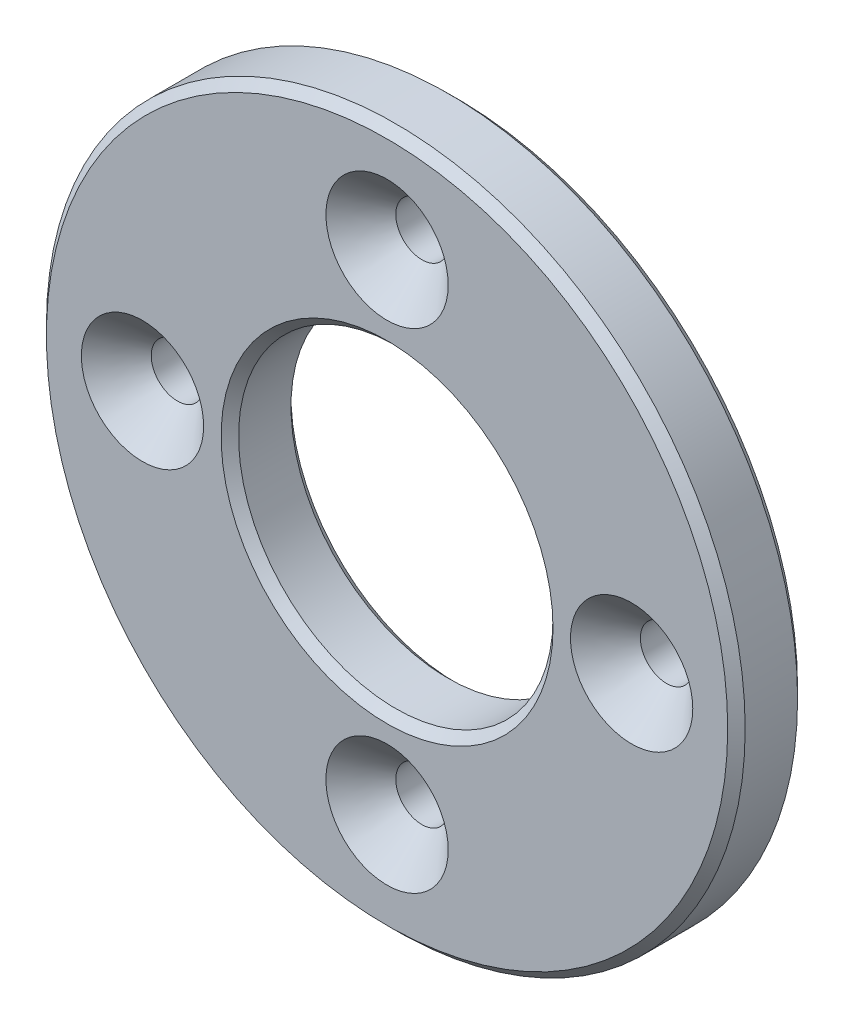
ISO-10303-21;
HEADER;
FILE_DESCRIPTION(('STEP AP214'),'2;1');
FILE_NAME('part.step','',(''),(''),'','','');
FILE_SCHEMA(('AUTOMOTIVE_DESIGN { 1 0 10303 214 1 1 1 1 }'));
ENDSEC;
DATA;
#1=APPLICATION_CONTEXT('core data for automotive mechanical design processes');
#2=APPLICATION_PROTOCOL_DEFINITION('international standard','automotive_design',2000,#1);
#3=PRODUCT_CONTEXT('',#1,'mechanical');
#4=PRODUCT('Part','Part','',(#3));
#5=PRODUCT_RELATED_PRODUCT_CATEGORY('part','',(#4));
#6=PRODUCT_DEFINITION_FORMATION('','',#4);
#7=PRODUCT_DEFINITION_CONTEXT('part definition',#1,'design');
#8=PRODUCT_DEFINITION('design','',#6,#7);
#9=PRODUCT_DEFINITION_SHAPE('','',#8);
#10=(LENGTH_UNIT() NAMED_UNIT(*) SI_UNIT(.MILLI.,.METRE.));
#11=(NAMED_UNIT(*) PLANE_ANGLE_UNIT() SI_UNIT($,.RADIAN.));
#12=(NAMED_UNIT(*) SI_UNIT($,.STERADIAN.) SOLID_ANGLE_UNIT());
#13=UNCERTAINTY_MEASURE_WITH_UNIT(LENGTH_MEASURE(1.E-05),#10,'distance_accuracy_value','');
#14=(GEOMETRIC_REPRESENTATION_CONTEXT(3) GLOBAL_UNCERTAINTY_ASSIGNED_CONTEXT((#13)) GLOBAL_UNIT_ASSIGNED_CONTEXT((#10,
#11,#12)) REPRESENTATION_CONTEXT('',''));
#15=CARTESIAN_POINT('',(0.,0.,0.));
#16=DIRECTION('',(0.,0.,1.));
#17=DIRECTION('',(1.,0.,0.));
#18=AXIS2_PLACEMENT_3D('',#15,#16,#17);
#19=CARTESIAN_POINT('',(0.,0.,4.));
#20=DIRECTION('',(0.,0.,1.));
#21=DIRECTION('',(1.,0.,0.));
#22=AXIS2_PLACEMENT_3D('',#19,#20,#21);
#23=PLANE('',#22);
#24=CARTESIAN_POINT('',(0.,0.,4.));
#25=DIRECTION('',(0.,0.,1.));
#26=DIRECTION('',(1.,0.,0.));
#27=AXIS2_PLACEMENT_3D('',#24,#25,#26);
#28=CIRCLE('',#27,9.5);
#29=CARTESIAN_POINT('',(9.5,0.,4.));
#30=VERTEX_POINT('',#29);
#31=EDGE_CURVE('E39',#30,#30,#28,.F.);
#32=ORIENTED_EDGE('',*,*,#31,.T.);
#33=EDGE_LOOP('',(#32));
#34=FACE_BOUND('',#33,.T.);
#35=CARTESIAN_POINT('',(0.,0.,4.));
#36=DIRECTION('',(0.,0.,1.));
#37=DIRECTION('',(1.,0.,0.));
#38=AXIS2_PLACEMENT_3D('',#35,#36,#37);
#39=CIRCLE('',#38,19.5);
#40=CARTESIAN_POINT('',(19.5,0.,4.));
#41=VERTEX_POINT('',#40);
#42=EDGE_CURVE('E43',#41,#41,#39,.T.);
#43=ORIENTED_EDGE('',*,*,#42,.T.);
#44=EDGE_LOOP('',(#43));
#45=FACE_BOUND('',#44,.T.);
#46=CARTESIAN_POINT('',(0.,-14.,4.));
#47=DIRECTION('',(0.,0.,1.));
#48=DIRECTION('',(1.,0.,0.));
#49=AXIS2_PLACEMENT_3D('',#46,#47,#48);
#50=CIRCLE('',#49,3.5);
#51=CARTESIAN_POINT('',(3.50000000000005,-14.,4.));
#52=VERTEX_POINT('',#51);
#53=EDGE_CURVE('E69',#52,#52,#50,.F.);
#54=ORIENTED_EDGE('',*,*,#53,.T.);
#55=EDGE_LOOP('',(#54));
#56=FACE_BOUND('',#55,.T.);
#57=CARTESIAN_POINT('',(14.,0.,4.));
#58=DIRECTION('',(0.,0.,1.));
#59=DIRECTION('',(1.,0.,0.));
#60=AXIS2_PLACEMENT_3D('',#57,#58,#59);
#61=CIRCLE('',#60,3.5);
#62=CARTESIAN_POINT('',(17.5,0.,4.));
#63=VERTEX_POINT('',#62);
#64=EDGE_CURVE('E72',#63,#63,#61,.F.);
#65=ORIENTED_EDGE('',*,*,#64,.T.);
#66=EDGE_LOOP('',(#65));
#67=FACE_BOUND('',#66,.T.);
#68=CARTESIAN_POINT('',(0.,14.,4.));
#69=DIRECTION('',(0.,0.,1.));
#70=DIRECTION('',(1.,0.,0.));
#71=AXIS2_PLACEMENT_3D('',#68,#69,#70);
#72=CIRCLE('',#71,3.5);
#73=CARTESIAN_POINT('',(3.5,14.,4.));
#74=VERTEX_POINT('',#73);
#75=EDGE_CURVE('E75',#74,#74,#72,.F.);
#76=ORIENTED_EDGE('',*,*,#75,.T.);
#77=EDGE_LOOP('',(#76));
#78=FACE_BOUND('',#77,.T.);
#79=CARTESIAN_POINT('',(-14.,0.,4.));
#80=DIRECTION('',(0.,0.,1.));
#81=DIRECTION('',(1.,0.,0.));
#82=AXIS2_PLACEMENT_3D('',#79,#80,#81);
#83=CIRCLE('',#82,3.5);
#84=CARTESIAN_POINT('',(-10.5,0.,4.));
#85=VERTEX_POINT('',#84);
#86=EDGE_CURVE('E78',#85,#85,#83,.F.);
#87=ORIENTED_EDGE('',*,*,#86,.T.);
#88=EDGE_LOOP('',(#87));
#89=FACE_BOUND('',#88,.T.);
#90=ADVANCED_FACE('F28',(#34,#45,#56,#67,#78,#89),#23,.T.);
#91=CARTESIAN_POINT('',(0.,0.,0.));
#92=DIRECTION('',(0.,0.,1.));
#93=DIRECTION('',(1.,0.,0.));
#94=AXIS2_PLACEMENT_3D('',#91,#92,#93);
#95=PLANE('',#94);
#96=CARTESIAN_POINT('',(0.,0.,0.));
#97=DIRECTION('',(0.,0.,1.));
#98=DIRECTION('',(1.,0.,0.));
#99=AXIS2_PLACEMENT_3D('',#96,#97,#98);
#100=CIRCLE('',#99,9.5);
#101=CARTESIAN_POINT('',(9.5,0.,0.));
#102=VERTEX_POINT('',#101);
#103=EDGE_CURVE('E54',#102,#102,#100,.T.);
#104=ORIENTED_EDGE('',*,*,#103,.T.);
#105=EDGE_LOOP('',(#104));
#106=FACE_BOUND('',#105,.T.);
#107=CARTESIAN_POINT('',(0.,0.,0.));
#108=DIRECTION('',(0.,0.,1.));
#109=DIRECTION('',(1.,0.,0.));
#110=AXIS2_PLACEMENT_3D('',#107,#108,#109);
#111=CIRCLE('',#110,19.5);
#112=CARTESIAN_POINT('',(19.5,0.,0.));
#113=VERTEX_POINT('',#112);
#114=EDGE_CURVE('E57',#113,#113,#111,.F.);
#115=ORIENTED_EDGE('',*,*,#114,.T.);
#116=EDGE_LOOP('',(#115));
#117=FACE_BOUND('',#116,.T.);
#118=CARTESIAN_POINT('',(14.,0.,0.));
#119=DIRECTION('',(0.,0.,1.));
#120=DIRECTION('',(-1.,0.,0.));
#121=AXIS2_PLACEMENT_3D('',#118,#119,#120);
#122=CIRCLE('',#121,1.5);
#123=CARTESIAN_POINT('',(12.5,0.,0.));
#124=VERTEX_POINT('',#123);
#125=EDGE_CURVE('E90',#124,#124,#122,.T.);
#126=ORIENTED_EDGE('',*,*,#125,.T.);
#127=EDGE_LOOP('',(#126));
#128=FACE_BOUND('',#127,.T.);
#129=CARTESIAN_POINT('',(0.,14.,0.));
#130=DIRECTION('',(0.,0.,1.));
#131=DIRECTION('',(1.,0.,0.));
#132=AXIS2_PLACEMENT_3D('',#129,#130,#131);
#133=CIRCLE('',#132,1.5);
#134=CARTESIAN_POINT('',(1.5,14.,0.));
#135=VERTEX_POINT('',#134);
#136=EDGE_CURVE('E84',#135,#135,#133,.T.);
#137=ORIENTED_EDGE('',*,*,#136,.T.);
#138=EDGE_LOOP('',(#137));
#139=FACE_BOUND('',#138,.T.);
#140=CARTESIAN_POINT('',(-14.,0.,0.));
#141=DIRECTION('',(0.,0.,1.));
#142=DIRECTION('',(1.,0.,0.));
#143=AXIS2_PLACEMENT_3D('',#140,#141,#142);
#144=CIRCLE('',#143,1.5);
#145=CARTESIAN_POINT('',(-12.5,0.,0.));
#146=VERTEX_POINT('',#145);
#147=EDGE_CURVE('E87',#146,#146,#144,.T.);
#148=ORIENTED_EDGE('',*,*,#147,.T.);
#149=EDGE_LOOP('',(#148));
#150=FACE_BOUND('',#149,.T.);
#151=CARTESIAN_POINT('',(0.,-14.,0.));
#152=DIRECTION('',(0.,0.,1.));
#153=DIRECTION('',(-1.,0.,0.));
#154=AXIS2_PLACEMENT_3D('',#151,#152,#153);
#155=CIRCLE('',#154,1.5);
#156=CARTESIAN_POINT('',(-1.49999999999995,-14.,0.));
#157=VERTEX_POINT('',#156);
#158=EDGE_CURVE('E93',#157,#157,#155,.T.);
#159=ORIENTED_EDGE('',*,*,#158,.T.);
#160=EDGE_LOOP('',(#159));
#161=FACE_BOUND('',#160,.T.);
#162=ADVANCED_FACE('F97',(#106,#117,#128,#139,#150,#161),#95,.F.);
#163=CARTESIAN_POINT('',(0.,0.,4.));
#164=DIRECTION('',(0.,0.,-1.));
#165=DIRECTION('',(-1.,0.,0.));
#166=AXIS2_PLACEMENT_3D('',#163,#164,#165);
#167=CYLINDRICAL_SURFACE('',#166,20.);
#168=CARTESIAN_POINT('',(0.,0.,0.499999999999997));
#169=DIRECTION('',(0.,0.,1.));
#170=DIRECTION('',(1.,0.,0.));
#171=AXIS2_PLACEMENT_3D('',#168,#169,#170);
#172=CIRCLE('',#171,20.);
#173=CARTESIAN_POINT('',(20.,0.,0.499999999999997));
#174=VERTEX_POINT('',#173);
#175=EDGE_CURVE('E10',#174,#174,#172,.T.);
#176=ORIENTED_EDGE('',*,*,#175,.T.);
#177=EDGE_LOOP('',(#176));
#178=FACE_BOUND('',#177,.T.);
#179=CARTESIAN_POINT('',(0.,0.,3.5));
#180=DIRECTION('',(0.,0.,1.));
#181=DIRECTION('',(1.,0.,0.));
#182=AXIS2_PLACEMENT_3D('',#179,#180,#181);
#183=CIRCLE('',#182,20.);
#184=CARTESIAN_POINT('',(20.,0.,3.5));
#185=VERTEX_POINT('',#184);
#186=EDGE_CURVE('E35',#185,#185,#183,.F.);
#187=ORIENTED_EDGE('',*,*,#186,.T.);
#188=EDGE_LOOP('',(#187));
#189=FACE_BOUND('',#188,.T.);
#190=ADVANCED_FACE('F121',(#178,#189),#167,.T.);
#191=CARTESIAN_POINT('',(0.,0.,4.));
#192=DIRECTION('',(0.,0.,-1.));
#193=DIRECTION('',(-1.,0.,0.));
#194=AXIS2_PLACEMENT_3D('',#191,#192,#193);
#195=CYLINDRICAL_SURFACE('',#194,9.);
#196=CARTESIAN_POINT('',(0.,0.,0.500000000000004));
#197=DIRECTION('',(0.,0.,1.));
#198=DIRECTION('',(1.,0.,0.));
#199=AXIS2_PLACEMENT_3D('',#196,#197,#198);
#200=CIRCLE('',#199,9.);
#201=CARTESIAN_POINT('',(9.,0.,0.500000000000004));
#202=VERTEX_POINT('',#201);
#203=EDGE_CURVE('E48',#202,#202,#200,.F.);
#204=ORIENTED_EDGE('',*,*,#203,.T.);
#205=EDGE_LOOP('',(#204));
#206=FACE_BOUND('',#205,.T.);
#207=CARTESIAN_POINT('',(0.,0.,3.5));
#208=DIRECTION('',(0.,0.,1.));
#209=DIRECTION('',(1.,0.,0.));
#210=AXIS2_PLACEMENT_3D('',#207,#208,#209);
#211=CIRCLE('',#210,9.);
#212=CARTESIAN_POINT('',(9.,0.,3.5));
#213=VERTEX_POINT('',#212);
#214=EDGE_CURVE('E51',#213,#213,#211,.T.);
#215=ORIENTED_EDGE('',*,*,#214,.T.);
#216=EDGE_LOOP('',(#215));
#217=FACE_BOUND('',#216,.T.);
#218=ADVANCED_FACE('F126',(#206,#217),#195,.F.);
#219=CARTESIAN_POINT('',(0.,14.,4.));
#220=DIRECTION('',(0.,0.,-1.));
#221=DIRECTION('',(-1.,0.,0.));
#222=AXIS2_PLACEMENT_3D('',#219,#220,#221);
#223=CYLINDRICAL_SURFACE('',#222,1.5);
#224=CARTESIAN_POINT('',(0.,14.,2.00000000000001));
#225=DIRECTION('',(0.,0.,1.));
#226=DIRECTION('',(1.,0.,0.));
#227=AXIS2_PLACEMENT_3D('',#224,#225,#226);
#228=CIRCLE('',#227,1.5);
#229=CARTESIAN_POINT('',(1.5,14.,2.00000000000001));
#230=VERTEX_POINT('',#229);
#231=EDGE_CURVE('E63',#230,#230,#228,.T.);
#232=ORIENTED_EDGE('',*,*,#231,.T.);
#233=EDGE_LOOP('',(#232));
#234=FACE_BOUND('',#233,.T.);
#235=ORIENTED_EDGE('',*,*,#136,.F.);
#236=EDGE_LOOP('',(#235));
#237=FACE_BOUND('',#236,.T.);
#238=ADVANCED_FACE('F167',(#234,#237),#223,.F.);
#239=CARTESIAN_POINT('',(-14.,0.,4.));
#240=DIRECTION('',(0.,0.,-1.));
#241=DIRECTION('',(-1.,0.,0.));
#242=AXIS2_PLACEMENT_3D('',#239,#240,#241);
#243=CYLINDRICAL_SURFACE('',#242,1.5);
#244=CARTESIAN_POINT('',(-14.,0.,2.));
#245=DIRECTION('',(0.,0.,1.));
#246=DIRECTION('',(1.,0.,0.));
#247=AXIS2_PLACEMENT_3D('',#244,#245,#246);
#248=CIRCLE('',#247,1.5);
#249=CARTESIAN_POINT('',(-12.5,0.,2.));
#250=VERTEX_POINT('',#249);
#251=EDGE_CURVE('E60',#250,#250,#248,.T.);
#252=ORIENTED_EDGE('',*,*,#251,.T.);
#253=EDGE_LOOP('',(#252));
#254=FACE_BOUND('',#253,.T.);
#255=ORIENTED_EDGE('',*,*,#147,.F.);
#256=EDGE_LOOP('',(#255));
#257=FACE_BOUND('',#256,.T.);
#258=ADVANCED_FACE('F112',(#254,#257),#243,.F.);
#259=CARTESIAN_POINT('',(14.,0.,4.));
#260=DIRECTION('',(0.,0.,-1.));
#261=DIRECTION('',(-1.,0.,0.));
#262=AXIS2_PLACEMENT_3D('',#259,#260,#261);
#263=CYLINDRICAL_SURFACE('',#262,1.5);
#264=CARTESIAN_POINT('',(14.,0.,2.00000000000001));
#265=DIRECTION('',(0.,0.,1.));
#266=DIRECTION('',(1.,0.,0.));
#267=AXIS2_PLACEMENT_3D('',#264,#265,#266);
#268=CIRCLE('',#267,1.5);
#269=CARTESIAN_POINT('',(15.5,0.,2.00000000000001));
#270=VERTEX_POINT('',#269);
#271=EDGE_CURVE('E66',#270,#270,#268,.T.);
#272=ORIENTED_EDGE('',*,*,#271,.T.);
#273=EDGE_LOOP('',(#272));
#274=FACE_BOUND('',#273,.T.);
#275=ORIENTED_EDGE('',*,*,#125,.F.);
#276=EDGE_LOOP('',(#275));
#277=FACE_BOUND('',#276,.T.);
#278=ADVANCED_FACE('F102',(#274,#277),#263,.F.);
#279=CARTESIAN_POINT('',(0.,-14.,4.));
#280=DIRECTION('',(0.,0.,-1.));
#281=DIRECTION('',(-1.,0.,0.));
#282=AXIS2_PLACEMENT_3D('',#279,#280,#281);
#283=CYLINDRICAL_SURFACE('',#282,1.5);
#284=CARTESIAN_POINT('',(0.,-14.,2.));
#285=DIRECTION('',(0.,0.,1.));
#286=DIRECTION('',(1.,0.,0.));
#287=AXIS2_PLACEMENT_3D('',#284,#285,#286);
#288=CIRCLE('',#287,1.5);
#289=CARTESIAN_POINT('',(1.50000000000005,-14.,2.));
#290=VERTEX_POINT('',#289);
#291=EDGE_CURVE('E81',#290,#290,#288,.T.);
#292=ORIENTED_EDGE('',*,*,#291,.T.);
#293=EDGE_LOOP('',(#292));
#294=FACE_BOUND('',#293,.T.);
#295=ORIENTED_EDGE('',*,*,#158,.F.);
#296=EDGE_LOOP('',(#295));
#297=FACE_BOUND('',#296,.T.);
#298=ADVANCED_FACE('F99',(#294,#297),#283,.F.);
#299=CARTESIAN_POINT('',(0.,-14.,2.));
#300=DIRECTION('',(0.,0.,1.));
#301=DIRECTION('',(1.,0.,0.));
#302=AXIS2_PLACEMENT_3D('',#299,#300,#301);
#303=CONICAL_SURFACE('',#302,1.5,0.785398163397449);
#304=ORIENTED_EDGE('',*,*,#53,.F.);
#305=EDGE_LOOP('',(#304));
#306=FACE_BOUND('',#305,.T.);
#307=ORIENTED_EDGE('',*,*,#291,.F.);
#308=EDGE_LOOP('',(#307));
#309=FACE_BOUND('',#308,.T.);
#310=ADVANCED_FACE('F101',(#306,#309),#303,.F.);
#311=CARTESIAN_POINT('',(14.,0.,2.00000000000001));
#312=DIRECTION('',(0.,0.,1.));
#313=DIRECTION('',(1.,0.,0.));
#314=AXIS2_PLACEMENT_3D('',#311,#312,#313);
#315=CONICAL_SURFACE('',#314,1.5,0.785398163397449);
#316=ORIENTED_EDGE('',*,*,#64,.F.);
#317=EDGE_LOOP('',(#316));
#318=FACE_BOUND('',#317,.T.);
#319=ORIENTED_EDGE('',*,*,#271,.F.);
#320=EDGE_LOOP('',(#319));
#321=FACE_BOUND('',#320,.T.);
#322=ADVANCED_FACE('F109',(#318,#321),#315,.F.);
#323=CARTESIAN_POINT('',(0.,14.,2.00000000000001));
#324=DIRECTION('',(0.,0.,1.));
#325=DIRECTION('',(1.,0.,0.));
#326=AXIS2_PLACEMENT_3D('',#323,#324,#325);
#327=CONICAL_SURFACE('',#326,1.5,0.785398163397449);
#328=ORIENTED_EDGE('',*,*,#75,.F.);
#329=EDGE_LOOP('',(#328));
#330=FACE_BOUND('',#329,.T.);
#331=ORIENTED_EDGE('',*,*,#231,.F.);
#332=EDGE_LOOP('',(#331));
#333=FACE_BOUND('',#332,.T.);
#334=ADVANCED_FACE('F133',(#330,#333),#327,.F.);
#335=CARTESIAN_POINT('',(-14.,0.,2.));
#336=DIRECTION('',(0.,0.,1.));
#337=DIRECTION('',(1.,0.,0.));
#338=AXIS2_PLACEMENT_3D('',#335,#336,#337);
#339=CONICAL_SURFACE('',#338,1.5,0.785398163397449);
#340=ORIENTED_EDGE('',*,*,#86,.F.);
#341=EDGE_LOOP('',(#340));
#342=FACE_BOUND('',#341,.T.);
#343=ORIENTED_EDGE('',*,*,#251,.F.);
#344=EDGE_LOOP('',(#343));
#345=FACE_BOUND('',#344,.T.);
#346=ADVANCED_FACE('F137',(#342,#345),#339,.F.);
#347=CARTESIAN_POINT('',(0.,0.,0.));
#348=DIRECTION('',(0.,0.,-1.));
#349=DIRECTION('',(-1.,0.,0.));
#350=AXIS2_PLACEMENT_3D('',#347,#348,#349);
#351=CONICAL_SURFACE('',#350,9.5,0.785398163397443);
#352=ORIENTED_EDGE('',*,*,#203,.F.);
#353=EDGE_LOOP('',(#352));
#354=FACE_BOUND('',#353,.T.);
#355=ORIENTED_EDGE('',*,*,#103,.F.);
#356=EDGE_LOOP('',(#355));
#357=FACE_BOUND('',#356,.T.);
#358=ADVANCED_FACE('F141',(#354,#357),#351,.F.);
#359=CARTESIAN_POINT('',(0.,0.,3.5));
#360=DIRECTION('',(0.,0.,1.));
#361=DIRECTION('',(1.,0.,0.));
#362=AXIS2_PLACEMENT_3D('',#359,#360,#361);
#363=CONICAL_SURFACE('',#362,9.,0.785398163397447);
#364=ORIENTED_EDGE('',*,*,#31,.F.);
#365=EDGE_LOOP('',(#364));
#366=FACE_BOUND('',#365,.T.);
#367=ORIENTED_EDGE('',*,*,#214,.F.);
#368=EDGE_LOOP('',(#367));
#369=FACE_BOUND('',#368,.T.);
#370=ADVANCED_FACE('F145',(#366,#369),#363,.F.);
#371=CARTESIAN_POINT('',(0.,0.,0.499999999999997));
#372=DIRECTION('',(0.,0.,1.));
#373=DIRECTION('',(1.,0.,0.));
#374=AXIS2_PLACEMENT_3D('',#371,#372,#373);
#375=CONICAL_SURFACE('',#374,20.,0.785398163397448);
#376=ORIENTED_EDGE('',*,*,#114,.F.);
#377=EDGE_LOOP('',(#376));
#378=FACE_BOUND('',#377,.T.);
#379=ORIENTED_EDGE('',*,*,#175,.F.);
#380=EDGE_LOOP('',(#379));
#381=FACE_BOUND('',#380,.T.);
#382=ADVANCED_FACE('F148',(#378,#381),#375,.T.);
#383=CARTESIAN_POINT('',(0.,0.,4.));
#384=DIRECTION('',(0.,0.,-1.));
#385=DIRECTION('',(-1.,0.,0.));
#386=AXIS2_PLACEMENT_3D('',#383,#384,#385);
#387=CONICAL_SURFACE('',#386,19.5,0.785398163397445);
#388=ORIENTED_EDGE('',*,*,#186,.F.);
#389=EDGE_LOOP('',(#388));
#390=FACE_BOUND('',#389,.T.);
#391=ORIENTED_EDGE('',*,*,#42,.F.);
#392=EDGE_LOOP('',(#391));
#393=FACE_BOUND('',#392,.T.);
#394=ADVANCED_FACE('F30',(#390,#393),#387,.T.);
#395=CLOSED_SHELL('',(#90,#162,#190,#218,#238,#258,#278,#298,#310,#322,#334,#346,#358,#370,#382,#394));
#396=MANIFOLD_SOLID_BREP('B2',#395);
#397=ADVANCED_BREP_SHAPE_REPRESENTATION('',(#18,#396),#14);
#398=SHAPE_DEFINITION_REPRESENTATION(#9,#397);
ENDSEC;
END-ISO-10303-21;
